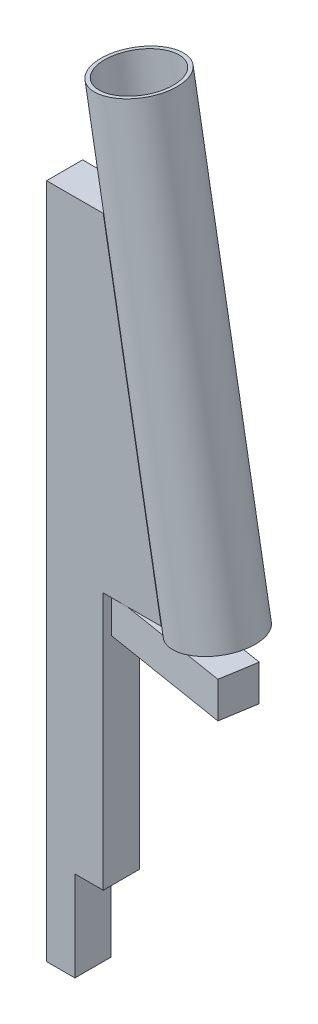
ISO-10303-21;
HEADER;
FILE_DESCRIPTION(('STEP AP214'),'2;1');
FILE_NAME('part.step','',(''),(''),'','','');
FILE_SCHEMA(('AUTOMOTIVE_DESIGN { 1 0 10303 214 1 1 1 1 }'));
ENDSEC;
DATA;
#1=APPLICATION_CONTEXT('core data for automotive mechanical design processes');
#2=APPLICATION_PROTOCOL_DEFINITION('international standard','automotive_design',2000,#1);
#3=PRODUCT_CONTEXT('',#1,'mechanical');
#4=PRODUCT('Part','Part','',(#3));
#5=PRODUCT_RELATED_PRODUCT_CATEGORY('part','',(#4));
#6=PRODUCT_DEFINITION_FORMATION('','',#4);
#7=PRODUCT_DEFINITION_CONTEXT('part definition',#1,'design');
#8=PRODUCT_DEFINITION('design','',#6,#7);
#9=PRODUCT_DEFINITION_SHAPE('','',#8);
#10=(LENGTH_UNIT() NAMED_UNIT(*) SI_UNIT(.MILLI.,.METRE.));
#11=(NAMED_UNIT(*) PLANE_ANGLE_UNIT() SI_UNIT($,.RADIAN.));
#12=(NAMED_UNIT(*) SI_UNIT($,.STERADIAN.) SOLID_ANGLE_UNIT());
#13=UNCERTAINTY_MEASURE_WITH_UNIT(LENGTH_MEASURE(1.E-05),#10,'distance_accuracy_value','');
#14=(GEOMETRIC_REPRESENTATION_CONTEXT(3) GLOBAL_UNCERTAINTY_ASSIGNED_CONTEXT((#13)) GLOBAL_UNIT_ASSIGNED_CONTEXT((#10,
#11,#12)) REPRESENTATION_CONTEXT('',''));
#15=CARTESIAN_POINT('',(0.,0.,0.));
#16=DIRECTION('',(0.,0.,1.));
#17=DIRECTION('',(1.,0.,0.));
#18=AXIS2_PLACEMENT_3D('',#15,#16,#17);
#19=CARTESIAN_POINT('',(57.7673704069417,619.892158884281,0.));
#20=DIRECTION('',(0.173648177666927,-0.984807753012209,0.));
#21=DIRECTION('',(0.984807753012209,0.173648177666927,0.));
#22=AXIS2_PLACEMENT_3D('',#19,#20,#21);
#23=CYLINDRICAL_SURFACE('',#22,30.);
#24=CARTESIAN_POINT('',(57.7673704069417,619.892158884281,0.));
#25=DIRECTION('',(0.173648177666927,-0.984807753012209,0.));
#26=DIRECTION('',(0.984807753012209,0.173648177666927,0.));
#27=AXIS2_PLACEMENT_3D('',#24,#25,#26);
#28=CIRCLE('',#27,30.);
#29=CARTESIAN_POINT('',(87.3116029973079,625.101604214288,0.));
#30=VERTEX_POINT('',#29);
#31=EDGE_CURVE('E11',#30,#30,#28,.T.);
#32=ORIENTED_EDGE('',*,*,#31,.T.);
#33=EDGE_LOOP('',(#32));
#34=FACE_BOUND('',#33,.T.);
#35=CARTESIAN_POINT('',(118.544232590366,275.209445330008,0.));
#36=DIRECTION('',(0.173648177666927,-0.984807753012209,0.));
#37=DIRECTION('',(0.984807753012209,0.173648177666927,0.));
#38=AXIS2_PLACEMENT_3D('',#35,#36,#37);
#39=CIRCLE('',#38,30.);
#40=CARTESIAN_POINT('',(148.088465180732,280.418890660016,0.));
#41=VERTEX_POINT('',#40);
#42=EDGE_CURVE('E43',#41,#41,#39,.T.);
#43=ORIENTED_EDGE('',*,*,#42,.F.);
#44=EDGE_LOOP('',(#43));
#45=FACE_BOUND('',#44,.T.);
#46=ADVANCED_FACE('F40',(#34,#45),#23,.T.);
#47=CARTESIAN_POINT('',(57.7673704069417,619.892158884281,0.));
#48=DIRECTION('',(0.173648177666927,-0.984807753012209,0.));
#49=DIRECTION('',(0.984807753012209,0.173648177666927,0.));
#50=AXIS2_PLACEMENT_3D('',#47,#48,#49);
#51=PLANE('',#50);
#52=CARTESIAN_POINT('',(57.7673704069417,619.892158884281,0.));
#53=DIRECTION('',(0.173648177666927,-0.984807753012209,0.));
#54=DIRECTION('',(0.984807753012209,0.173648177666927,0.));
#55=AXIS2_PLACEMENT_3D('',#52,#53,#54);
#56=CIRCLE('',#55,27.);
#57=CARTESIAN_POINT('',(84.3571797382713,624.580659681288,0.));
#58=VERTEX_POINT('',#57);
#59=EDGE_CURVE('E50',#58,#58,#56,.T.);
#60=ORIENTED_EDGE('',*,*,#59,.T.);
#61=EDGE_LOOP('',(#60));
#62=FACE_BOUND('',#61,.T.);
#63=ORIENTED_EDGE('',*,*,#31,.F.);
#64=EDGE_LOOP('',(#63));
#65=FACE_BOUND('',#64,.T.);
#66=ADVANCED_FACE('F58',(#62,#65),#51,.F.);
#67=CARTESIAN_POINT('',(118.544232590366,275.209445330008,0.));
#68=DIRECTION('',(0.173648177666927,-0.984807753012209,0.));
#69=DIRECTION('',(0.984807753012209,0.173648177666927,0.));
#70=AXIS2_PLACEMENT_3D('',#67,#68,#69);
#71=PLANE('',#70);
#72=CARTESIAN_POINT('',(118.544232590366,275.209445330008,0.));
#73=DIRECTION('',(0.173648177666927,-0.984807753012209,0.));
#74=DIRECTION('',(0.984807753012209,0.173648177666927,0.));
#75=AXIS2_PLACEMENT_3D('',#72,#73,#74);
#76=CIRCLE('',#75,27.);
#77=CARTESIAN_POINT('',(145.134041921696,279.897946127015,0.));
#78=VERTEX_POINT('',#77);
#79=EDGE_CURVE('E52',#78,#78,#76,.T.);
#80=ORIENTED_EDGE('',*,*,#79,.F.);
#81=EDGE_LOOP('',(#80));
#82=FACE_BOUND('',#81,.T.);
#83=ORIENTED_EDGE('',*,*,#42,.T.);
#84=EDGE_LOOP('',(#83));
#85=FACE_BOUND('',#84,.T.);
#86=ADVANCED_FACE('F64',(#82,#85),#71,.T.);
#87=CARTESIAN_POINT('',(57.7673704069417,619.892158884281,0.));
#88=DIRECTION('',(0.173648177666927,-0.984807753012209,0.));
#89=DIRECTION('',(0.984807753012209,0.173648177666927,0.));
#90=AXIS2_PLACEMENT_3D('',#87,#88,#89);
#91=CYLINDRICAL_SURFACE('',#90,27.);
#92=ORIENTED_EDGE('',*,*,#59,.F.);
#93=EDGE_LOOP('',(#92));
#94=FACE_BOUND('',#93,.T.);
#95=ORIENTED_EDGE('',*,*,#79,.T.);
#96=EDGE_LOOP('',(#95));
#97=FACE_BOUND('',#96,.T.);
#98=ADVANCED_FACE('F61',(#94,#97),#91,.F.);
#99=CLOSED_SHELL('',(#46,#66,#86,#98));
#100=MANIFOLD_SOLID_BREP('B2',#99);
#101=CARTESIAN_POINT('',(44.,270.,14.));
#102=DIRECTION('',(0.,1.,0.));
#103=DIRECTION('',(0.,0.,1.));
#104=AXIS2_PLACEMENT_3D('',#101,#102,#103);
#105=PLANE('',#104);
#106=DIRECTION('',(0.987007269930511,0.,0.160675602081711));
#107=VECTOR('',#106,1.);
#108=CARTESIAN_POINT('',(52.4313566501168,270.,-16.0675602081711));
#109=LINE('',#108,#107);
#110=CARTESIAN_POINT('',(65.1320836431679,270.,-14.));
#111=VERTEX_POINT('',#110);
#112=CARTESIAN_POINT('',(89.,270.,-10.1145252442366));
#113=VERTEX_POINT('',#112);
#114=EDGE_CURVE('E328',#111,#113,#109,.T.);
#115=ORIENTED_EDGE('',*,*,#114,.F.);
#116=DIRECTION('',(1.,0.,0.));
#117=VECTOR('',#116,1.);
#118=CARTESIAN_POINT('',(44.,270.,-14.));
#119=LINE('',#118,#117);
#120=CARTESIAN_POINT('',(89.,270.,-14.));
#121=VERTEX_POINT('',#120);
#122=EDGE_CURVE('E270',#111,#121,#119,.T.);
#123=ORIENTED_EDGE('',*,*,#122,.T.);
#124=DIRECTION('',(0.,0.,-1.));
#125=VECTOR('',#124,1.);
#126=CARTESIAN_POINT('',(89.,270.,14.));
#127=LINE('',#126,#125);
#128=EDGE_CURVE('E124',#113,#121,#127,.T.);
#129=ORIENTED_EDGE('',*,*,#128,.F.);
#130=EDGE_LOOP('',(#115,#123,#129));
#131=FACE_BOUND('',#130,.T.);
#132=ADVANCED_FACE('F101',(#131),#105,.F.);
#133=DIRECTION('',(0.160675602081711,0.,-0.98700726993051));
#134=VECTOR('',#133,1.);
#135=CARTESIAN_POINT('',(47.9324397918289,270.,11.5686433498832));
#136=LINE('',#135,#134);
#137=CARTESIAN_POINT('',(47.9324397918289,270.,11.5686433498832));
#138=VERTEX_POINT('',#137);
#139=CARTESIAN_POINT('',(52.0947770813448,270.,-14.));
#140=VERTEX_POINT('',#139);
#141=EDGE_CURVE('E116',#138,#140,#136,.T.);
#142=ORIENTED_EDGE('',*,*,#141,.F.);
#143=DIRECTION('',(-0.98700726993051,0.,-0.160675602081711));
#144=VECTOR('',#143,1.);
#145=CARTESIAN_POINT('',(47.9324397918289,270.,11.5686433498832));
#146=LINE('',#145,#144);
#147=CARTESIAN_POINT('',(62.8679163568321,270.,14.));
#148=VERTEX_POINT('',#147);
#149=EDGE_CURVE('E337',#148,#138,#146,.T.);
#150=ORIENTED_EDGE('',*,*,#149,.F.);
#151=DIRECTION('',(1.,0.,0.));
#152=VECTOR('',#151,1.);
#153=CARTESIAN_POINT('',(44.,270.,14.));
#154=LINE('',#153,#152);
#155=CARTESIAN_POINT('',(44.,270.,14.));
#156=VERTEX_POINT('',#155);
#157=EDGE_CURVE('E252',#156,#148,#154,.T.);
#158=ORIENTED_EDGE('',*,*,#157,.F.);
#159=DIRECTION('',(0.,0.,-1.));
#160=VECTOR('',#159,1.);
#161=CARTESIAN_POINT('',(44.,270.,14.));
#162=LINE('',#161,#160);
#163=CARTESIAN_POINT('',(44.,270.,-14.));
#164=VERTEX_POINT('',#163);
#165=EDGE_CURVE('E279',#156,#164,#162,.T.);
#166=ORIENTED_EDGE('',*,*,#165,.T.);
#167=EDGE_CURVE('E271',#164,#140,#119,.T.);
#168=ORIENTED_EDGE('',*,*,#167,.T.);
#169=EDGE_LOOP('',(#142,#150,#158,#166,#168));
#170=FACE_BOUND('',#169,.T.);
#171=ADVANCED_FACE('F358',(#170),#105,.F.);
#172=CARTESIAN_POINT('',(44.,525.207681882802,14.));
#173=DIRECTION('',(0.,-1.,0.));
#174=DIRECTION('',(0.,0.,-1.));
#175=AXIS2_PLACEMENT_3D('',#172,#173,#174);
#176=PLANE('',#175);
#177=DIRECTION('',(-1.,0.,0.));
#178=VECTOR('',#177,1.);
#179=CARTESIAN_POINT('',(44.,525.207681882802,-14.));
#180=LINE('',#179,#178);
#181=CARTESIAN_POINT('',(44.,525.207681882802,-14.));
#182=VERTEX_POINT('',#181);
#183=CARTESIAN_POINT('',(0.,525.207681882802,-14.));
#184=VERTEX_POINT('',#183);
#185=EDGE_CURVE('E232',#182,#184,#180,.T.);
#186=ORIENTED_EDGE('',*,*,#185,.T.);
#187=DIRECTION('',(0.,0.,-1.));
#188=VECTOR('',#187,1.);
#189=CARTESIAN_POINT('',(0.,525.207681882802,14.));
#190=LINE('',#189,#188);
#191=CARTESIAN_POINT('',(0.,525.207681882802,14.));
#192=VERTEX_POINT('',#191);
#193=EDGE_CURVE('E38',#192,#184,#190,.T.);
#194=ORIENTED_EDGE('',*,*,#193,.F.);
#195=DIRECTION('',(-1.,0.,0.));
#196=VECTOR('',#195,1.);
#197=CARTESIAN_POINT('',(44.,525.207681882802,14.));
#198=LINE('',#197,#196);
#199=CARTESIAN_POINT('',(44.,525.207681882802,14.));
#200=VERTEX_POINT('',#199);
#201=EDGE_CURVE('E238',#200,#192,#198,.T.);
#202=ORIENTED_EDGE('',*,*,#201,.F.);
#203=DIRECTION('',(0.,0.,-1.));
#204=VECTOR('',#203,1.);
#205=CARTESIAN_POINT('',(44.,525.207681882802,14.));
#206=LINE('',#205,#204);
#207=EDGE_CURVE('E257',#200,#182,#206,.T.);
#208=ORIENTED_EDGE('',*,*,#207,.T.);
#209=EDGE_LOOP('',(#186,#194,#202,#208));
#210=FACE_BOUND('',#209,.T.);
#211=ADVANCED_FACE('F103',(#210),#176,.F.);
#212=CARTESIAN_POINT('',(0.,525.207681882802,14.));
#213=DIRECTION('',(1.,0.,0.));
#214=DIRECTION('',(0.,1.,0.));
#215=AXIS2_PLACEMENT_3D('',#212,#213,#214);
#216=PLANE('',#215);
#217=DIRECTION('',(0.,-1.,0.));
#218=VECTOR('',#217,1.);
#219=CARTESIAN_POINT('',(0.,525.207681882802,-14.));
#220=LINE('',#219,#218);
#221=CARTESIAN_POINT('',(0.,0.,-14.));
#222=VERTEX_POINT('',#221);
#223=EDGE_CURVE('E260',#184,#222,#220,.T.);
#224=ORIENTED_EDGE('',*,*,#223,.T.);
#225=DIRECTION('',(0.,0.,-1.));
#226=VECTOR('',#225,1.);
#227=CARTESIAN_POINT('',(0.,0.,14.));
#228=LINE('',#227,#226);
#229=CARTESIAN_POINT('',(0.,0.,14.));
#230=VERTEX_POINT('',#229);
#231=EDGE_CURVE('E109',#230,#222,#228,.T.);
#232=ORIENTED_EDGE('',*,*,#231,.F.);
#233=DIRECTION('',(0.,-1.,0.));
#234=VECTOR('',#233,1.);
#235=CARTESIAN_POINT('',(0.,525.207681882802,14.));
#236=LINE('',#235,#234);
#237=EDGE_CURVE('E241',#192,#230,#236,.T.);
#238=ORIENTED_EDGE('',*,*,#237,.F.);
#239=ORIENTED_EDGE('',*,*,#193,.T.);
#240=EDGE_LOOP('',(#224,#232,#238,#239));
#241=FACE_BOUND('',#240,.T.);
#242=ADVANCED_FACE('F318',(#241),#216,.F.);
#243=CARTESIAN_POINT('',(0.,0.,14.));
#244=DIRECTION('',(0.,1.,0.));
#245=DIRECTION('',(0.,0.,1.));
#246=AXIS2_PLACEMENT_3D('',#243,#244,#245);
#247=PLANE('',#246);
#248=DIRECTION('',(1.,0.,0.));
#249=VECTOR('',#248,1.);
#250=CARTESIAN_POINT('',(0.,0.,-14.));
#251=LINE('',#250,#249);
#252=CARTESIAN_POINT('',(22.,0.,-14.));
#253=VERTEX_POINT('',#252);
#254=EDGE_CURVE('E262',#222,#253,#251,.T.);
#255=ORIENTED_EDGE('',*,*,#254,.T.);
#256=DIRECTION('',(0.,0.,-1.));
#257=VECTOR('',#256,1.);
#258=CARTESIAN_POINT('',(22.,0.,14.));
#259=LINE('',#258,#257);
#260=CARTESIAN_POINT('',(22.,0.,14.));
#261=VERTEX_POINT('',#260);
#262=EDGE_CURVE('E288',#261,#253,#259,.T.);
#263=ORIENTED_EDGE('',*,*,#262,.F.);
#264=DIRECTION('',(1.,0.,0.));
#265=VECTOR('',#264,1.);
#266=CARTESIAN_POINT('',(0.,0.,14.));
#267=LINE('',#266,#265);
#268=EDGE_CURVE('E244',#230,#261,#267,.T.);
#269=ORIENTED_EDGE('',*,*,#268,.F.);
#270=ORIENTED_EDGE('',*,*,#231,.T.);
#271=EDGE_LOOP('',(#255,#263,#269,#270));
#272=FACE_BOUND('',#271,.T.);
#273=ADVANCED_FACE('F295',(#272),#247,.F.);
#274=CARTESIAN_POINT('',(22.,0.,14.));
#275=DIRECTION('',(-1.,0.,0.));
#276=DIRECTION('',(0.,0.,1.));
#277=AXIS2_PLACEMENT_3D('',#274,#275,#276);
#278=PLANE('',#277);
#279=DIRECTION('',(0.,1.,0.));
#280=VECTOR('',#279,1.);
#281=CARTESIAN_POINT('',(22.,0.,-14.));
#282=LINE('',#281,#280);
#283=CARTESIAN_POINT('',(22.,70.,-14.));
#284=VERTEX_POINT('',#283);
#285=EDGE_CURVE('E264',#253,#284,#282,.T.);
#286=ORIENTED_EDGE('',*,*,#285,.T.);
#287=DIRECTION('',(0.,0.,-1.));
#288=VECTOR('',#287,1.);
#289=CARTESIAN_POINT('',(22.,70.,14.));
#290=LINE('',#289,#288);
#291=CARTESIAN_POINT('',(22.,70.,14.));
#292=VERTEX_POINT('',#291);
#293=EDGE_CURVE('E285',#292,#284,#290,.T.);
#294=ORIENTED_EDGE('',*,*,#293,.F.);
#295=DIRECTION('',(0.,1.,0.));
#296=VECTOR('',#295,1.);
#297=CARTESIAN_POINT('',(22.,0.,14.));
#298=LINE('',#297,#296);
#299=EDGE_CURVE('E246',#261,#292,#298,.T.);
#300=ORIENTED_EDGE('',*,*,#299,.F.);
#301=ORIENTED_EDGE('',*,*,#262,.T.);
#302=EDGE_LOOP('',(#286,#294,#300,#301));
#303=FACE_BOUND('',#302,.T.);
#304=ADVANCED_FACE('F306',(#303),#278,.F.);
#305=CARTESIAN_POINT('',(22.,70.,14.));
#306=DIRECTION('',(0.,1.,0.));
#307=DIRECTION('',(0.,0.,1.));
#308=AXIS2_PLACEMENT_3D('',#305,#306,#307);
#309=PLANE('',#308);
#310=DIRECTION('',(1.,0.,0.));
#311=VECTOR('',#310,1.);
#312=CARTESIAN_POINT('',(22.,70.,-14.));
#313=LINE('',#312,#311);
#314=CARTESIAN_POINT('',(44.,70.,-14.));
#315=VERTEX_POINT('',#314);
#316=EDGE_CURVE('E266',#284,#315,#313,.T.);
#317=ORIENTED_EDGE('',*,*,#316,.T.);
#318=DIRECTION('',(0.,0.,-1.));
#319=VECTOR('',#318,1.);
#320=CARTESIAN_POINT('',(44.,70.,14.));
#321=LINE('',#320,#319);
#322=CARTESIAN_POINT('',(44.,70.,14.));
#323=VERTEX_POINT('',#322);
#324=EDGE_CURVE('E282',#323,#315,#321,.T.);
#325=ORIENTED_EDGE('',*,*,#324,.F.);
#326=DIRECTION('',(1.,0.,0.));
#327=VECTOR('',#326,1.);
#328=CARTESIAN_POINT('',(22.,70.,14.));
#329=LINE('',#328,#327);
#330=EDGE_CURVE('E248',#292,#323,#329,.T.);
#331=ORIENTED_EDGE('',*,*,#330,.F.);
#332=ORIENTED_EDGE('',*,*,#293,.T.);
#333=EDGE_LOOP('',(#317,#325,#331,#332));
#334=FACE_BOUND('',#333,.T.);
#335=ADVANCED_FACE('F310',(#334),#309,.F.);
#336=CARTESIAN_POINT('',(44.,70.,14.));
#337=DIRECTION('',(-1.,0.,0.));
#338=DIRECTION('',(0.,0.,1.));
#339=AXIS2_PLACEMENT_3D('',#336,#337,#338);
#340=PLANE('',#339);
#341=DIRECTION('',(0.,1.,0.));
#342=VECTOR('',#341,1.);
#343=CARTESIAN_POINT('',(44.,70.,-14.));
#344=LINE('',#343,#342);
#345=EDGE_CURVE('E268',#315,#164,#344,.T.);
#346=ORIENTED_EDGE('',*,*,#345,.T.);
#347=ORIENTED_EDGE('',*,*,#165,.F.);
#348=DIRECTION('',(0.,1.,0.));
#349=VECTOR('',#348,1.);
#350=CARTESIAN_POINT('',(44.,70.,14.));
#351=LINE('',#350,#349);
#352=EDGE_CURVE('E250',#323,#156,#351,.T.);
#353=ORIENTED_EDGE('',*,*,#352,.F.);
#354=ORIENTED_EDGE('',*,*,#324,.T.);
#355=EDGE_LOOP('',(#346,#347,#353,#354));
#356=FACE_BOUND('',#355,.T.);
#357=ADVANCED_FACE('F360',(#356),#340,.F.);
#358=CARTESIAN_POINT('',(89.,270.,14.));
#359=DIRECTION('',(-0.984807753012209,-0.173648177666927,0.));
#360=DIRECTION('',(0.173648177666927,-0.984807753012209,0.));
#361=AXIS2_PLACEMENT_3D('',#358,#359,#360);
#362=PLANE('',#361);
#363=DIRECTION('',(-0.173648177666927,0.984807753012208,0.));
#364=VECTOR('',#363,1.);
#365=CARTESIAN_POINT('',(89.,270.,-14.));
#366=LINE('',#365,#364);
#367=EDGE_CURVE('E242',#121,#182,#366,.T.);
#368=ORIENTED_EDGE('',*,*,#367,.T.);
#369=ORIENTED_EDGE('',*,*,#207,.F.);
#370=DIRECTION('',(-0.173648177666927,0.984807753012208,0.));
#371=VECTOR('',#370,1.);
#372=CARTESIAN_POINT('',(89.,270.,14.));
#373=LINE('',#372,#371);
#374=CARTESIAN_POINT('',(89.,270.,14.));
#375=VERTEX_POINT('',#374);
#376=EDGE_CURVE('E255',#375,#200,#373,.T.);
#377=ORIENTED_EDGE('',*,*,#376,.F.);
#378=EDGE_CURVE('E277',#375,#113,#127,.T.);
#379=ORIENTED_EDGE('',*,*,#378,.T.);
#380=ORIENTED_EDGE('',*,*,#128,.T.);
#381=EDGE_LOOP('',(#368,#369,#377,#379,#380));
#382=FACE_BOUND('',#381,.T.);
#383=ADVANCED_FACE('F323',(#382),#362,.F.);
#384=CARTESIAN_POINT('',(0.,0.,14.));
#385=DIRECTION('',(0.,0.,1.));
#386=DIRECTION('',(1.,0.,0.));
#387=AXIS2_PLACEMENT_3D('',#384,#385,#386);
#388=PLANE('',#387);
#389=ORIENTED_EDGE('',*,*,#201,.T.);
#390=ORIENTED_EDGE('',*,*,#237,.T.);
#391=ORIENTED_EDGE('',*,*,#268,.T.);
#392=ORIENTED_EDGE('',*,*,#299,.T.);
#393=ORIENTED_EDGE('',*,*,#330,.T.);
#394=ORIENTED_EDGE('',*,*,#352,.T.);
#395=ORIENTED_EDGE('',*,*,#157,.T.);
#396=DIRECTION('',(1.,0.,0.));
#397=VECTOR('',#396,1.);
#398=CARTESIAN_POINT('',(0.,270.,14.));
#399=LINE('',#398,#397);
#400=EDGE_CURVE('E230',#148,#375,#399,.T.);
#401=ORIENTED_EDGE('',*,*,#400,.T.);
#402=ORIENTED_EDGE('',*,*,#376,.T.);
#403=EDGE_LOOP('',(#389,#390,#391,#392,#393,#394,#395,#401,#402));
#404=FACE_BOUND('',#403,.T.);
#405=ADVANCED_FACE('F314',(#404),#388,.T.);
#406=CARTESIAN_POINT('',(0.,0.,-14.));
#407=DIRECTION('',(0.,0.,1.));
#408=DIRECTION('',(1.,0.,0.));
#409=AXIS2_PLACEMENT_3D('',#406,#407,#408);
#410=PLANE('',#409);
#411=ORIENTED_EDGE('',*,*,#185,.F.);
#412=ORIENTED_EDGE('',*,*,#367,.F.);
#413=ORIENTED_EDGE('',*,*,#122,.F.);
#414=EDGE_CURVE('E273',#140,#111,#119,.T.);
#415=ORIENTED_EDGE('',*,*,#414,.F.);
#416=ORIENTED_EDGE('',*,*,#167,.F.);
#417=ORIENTED_EDGE('',*,*,#345,.F.);
#418=ORIENTED_EDGE('',*,*,#316,.F.);
#419=ORIENTED_EDGE('',*,*,#285,.F.);
#420=ORIENTED_EDGE('',*,*,#254,.F.);
#421=ORIENTED_EDGE('',*,*,#223,.F.);
#422=EDGE_LOOP('',(#411,#412,#413,#415,#416,#417,#418,#419,#420,#421));
#423=FACE_BOUND('',#422,.T.);
#424=ADVANCED_FACE('F301',(#423),#410,.F.);
#425=CARTESIAN_POINT('',(0.,270.,0.));
#426=DIRECTION('',(0.,-1.,0.));
#427=DIRECTION('',(0.,0.,-1.));
#428=AXIS2_PLACEMENT_3D('',#425,#426,#427);
#429=PLANE('',#428);
#430=CARTESIAN_POINT('',(151.132083643168,270.,0.));
#431=VERTEX_POINT('',#430);
#432=EDGE_CURVE('E336',#113,#431,#109,.T.);
#433=ORIENTED_EDGE('',*,*,#432,.F.);
#434=ORIENTED_EDGE('',*,*,#378,.F.);
#435=ORIENTED_EDGE('',*,*,#400,.F.);
#436=CARTESIAN_POINT('',(146.63316678488,270.,27.6362035580543));
#437=VERTEX_POINT('',#436);
#438=EDGE_CURVE('E224',#437,#148,#146,.T.);
#439=ORIENTED_EDGE('',*,*,#438,.F.);
#440=DIRECTION('',(-0.16067560208171,0.,0.987007269930511));
#441=VECTOR('',#440,1.);
#442=CARTESIAN_POINT('',(146.63316678488,270.,27.6362035580543));
#443=LINE('',#442,#441);
#444=EDGE_CURVE('E334',#431,#437,#443,.T.);
#445=ORIENTED_EDGE('',*,*,#444,.F.);
#446=EDGE_LOOP('',(#433,#434,#435,#439,#445));
#447=FACE_BOUND('',#446,.T.);
#448=ADVANCED_FACE('F356',(#447),#429,.F.);
#449=CARTESIAN_POINT('',(52.4313566501168,270.,-16.0675602081711));
#450=VERTEX_POINT('',#449);
#451=EDGE_CURVE('E228',#140,#450,#136,.T.);
#452=ORIENTED_EDGE('',*,*,#451,.F.);
#453=ORIENTED_EDGE('',*,*,#414,.T.);
#454=EDGE_CURVE('E332',#450,#111,#109,.T.);
#455=ORIENTED_EDGE('',*,*,#454,.F.);
#456=EDGE_LOOP('',(#452,#453,#455));
#457=FACE_BOUND('',#456,.T.);
#458=ADVANCED_FACE('F331',(#457),#429,.F.);
#459=CARTESIAN_POINT('',(47.9324397918289,242.,11.5686433498832));
#460=DIRECTION('',(0.98700726993051,0.,0.160675602081711));
#461=DIRECTION('',(0.160675602081711,0.,-0.98700726993051));
#462=AXIS2_PLACEMENT_3D('',#459,#460,#461);
#463=PLANE('',#462);
#464=ORIENTED_EDGE('',*,*,#141,.T.);
#465=ORIENTED_EDGE('',*,*,#451,.T.);
#466=DIRECTION('',(0.,1.,0.));
#467=VECTOR('',#466,1.);
#468=CARTESIAN_POINT('',(52.4313566501168,242.,-16.0675602081711));
#469=LINE('',#468,#467);
#470=CARTESIAN_POINT('',(52.4313566501168,242.,-16.0675602081711));
#471=VERTEX_POINT('',#470);
#472=EDGE_CURVE('E209',#471,#450,#469,.T.);
#473=ORIENTED_EDGE('',*,*,#472,.F.);
#474=DIRECTION('',(0.160675602081711,0.,-0.98700726993051));
#475=VECTOR('',#474,1.);
#476=CARTESIAN_POINT('',(47.9324397918289,242.,11.5686433498832));
#477=LINE('',#476,#475);
#478=CARTESIAN_POINT('',(47.9324397918289,242.,11.5686433498832));
#479=VERTEX_POINT('',#478);
#480=EDGE_CURVE('E215',#479,#471,#477,.T.);
#481=ORIENTED_EDGE('',*,*,#480,.F.);
#482=DIRECTION('',(0.,1.,0.));
#483=VECTOR('',#482,1.);
#484=CARTESIAN_POINT('',(47.9324397918289,242.,11.5686433498832));
#485=LINE('',#484,#483);
#486=EDGE_CURVE('E342',#479,#138,#485,.T.);
#487=ORIENTED_EDGE('',*,*,#486,.T.);
#488=EDGE_LOOP('',(#464,#465,#473,#481,#487));
#489=FACE_BOUND('',#488,.T.);
#490=ADVANCED_FACE('F226',(#489),#463,.F.);
#491=CARTESIAN_POINT('',(52.4313566501168,242.,-16.0675602081711));
#492=DIRECTION('',(-0.160675602081711,0.,0.987007269930511));
#493=DIRECTION('',(0.987007269930511,0.,0.160675602081711));
#494=AXIS2_PLACEMENT_3D('',#491,#492,#493);
#495=PLANE('',#494);
#496=ORIENTED_EDGE('',*,*,#454,.T.);
#497=ORIENTED_EDGE('',*,*,#114,.T.);
#498=ORIENTED_EDGE('',*,*,#432,.T.);
#499=DIRECTION('',(0.,1.,0.));
#500=VECTOR('',#499,1.);
#501=CARTESIAN_POINT('',(151.132083643168,242.,0.));
#502=LINE('',#501,#500);
#503=CARTESIAN_POINT('',(151.132083643168,242.,0.));
#504=VERTEX_POINT('',#503);
#505=EDGE_CURVE('E211',#504,#431,#502,.T.);
#506=ORIENTED_EDGE('',*,*,#505,.F.);
#507=DIRECTION('',(0.987007269930511,0.,0.160675602081711));
#508=VECTOR('',#507,1.);
#509=CARTESIAN_POINT('',(52.4313566501168,242.,-16.0675602081711));
#510=LINE('',#509,#508);
#511=EDGE_CURVE('E204',#471,#504,#510,.T.);
#512=ORIENTED_EDGE('',*,*,#511,.F.);
#513=ORIENTED_EDGE('',*,*,#472,.T.);
#514=EDGE_LOOP('',(#496,#497,#498,#506,#512,#513));
#515=FACE_BOUND('',#514,.T.);
#516=ADVANCED_FACE('F207',(#515),#495,.F.);
#517=CARTESIAN_POINT('',(146.63316678488,242.,27.6362035580543));
#518=DIRECTION('',(-0.987007269930511,0.,-0.16067560208171));
#519=DIRECTION('',(-0.16067560208171,0.,0.987007269930511));
#520=AXIS2_PLACEMENT_3D('',#517,#518,#519);
#521=PLANE('',#520);
#522=ORIENTED_EDGE('',*,*,#444,.T.);
#523=DIRECTION('',(0.,1.,0.));
#524=VECTOR('',#523,1.);
#525=CARTESIAN_POINT('',(146.63316678488,242.,27.6362035580543));
#526=LINE('',#525,#524);
#527=CARTESIAN_POINT('',(146.63316678488,242.,27.6362035580543));
#528=VERTEX_POINT('',#527);
#529=EDGE_CURVE('E234',#528,#437,#526,.T.);
#530=ORIENTED_EDGE('',*,*,#529,.F.);
#531=DIRECTION('',(-0.16067560208171,0.,0.987007269930511));
#532=VECTOR('',#531,1.);
#533=CARTESIAN_POINT('',(146.63316678488,242.,27.6362035580543));
#534=LINE('',#533,#532);
#535=EDGE_CURVE('E214',#504,#528,#534,.T.);
#536=ORIENTED_EDGE('',*,*,#535,.F.);
#537=ORIENTED_EDGE('',*,*,#505,.T.);
#538=EDGE_LOOP('',(#522,#530,#536,#537));
#539=FACE_BOUND('',#538,.T.);
#540=ADVANCED_FACE('F346',(#539),#521,.F.);
#541=CARTESIAN_POINT('',(47.9324397918289,242.,11.5686433498832));
#542=DIRECTION('',(0.160675602081711,0.,-0.987007269930511));
#543=DIRECTION('',(-0.987007269930511,0.,-0.160675602081711));
#544=AXIS2_PLACEMENT_3D('',#541,#542,#543);
#545=PLANE('',#544);
#546=ORIENTED_EDGE('',*,*,#438,.T.);
#547=ORIENTED_EDGE('',*,*,#149,.T.);
#548=ORIENTED_EDGE('',*,*,#486,.F.);
#549=DIRECTION('',(-0.98700726993051,0.,-0.160675602081711));
#550=VECTOR('',#549,1.);
#551=CARTESIAN_POINT('',(47.9324397918289,242.,11.5686433498832));
#552=LINE('',#551,#550);
#553=EDGE_CURVE('E220',#528,#479,#552,.T.);
#554=ORIENTED_EDGE('',*,*,#553,.F.);
#555=ORIENTED_EDGE('',*,*,#529,.T.);
#556=EDGE_LOOP('',(#546,#547,#548,#554,#555));
#557=FACE_BOUND('',#556,.T.);
#558=ADVANCED_FACE('F351',(#557),#545,.F.);
#559=CARTESIAN_POINT('',(0.,242.,0.));
#560=DIRECTION('',(0.,-1.,0.));
#561=DIRECTION('',(0.,0.,-1.));
#562=AXIS2_PLACEMENT_3D('',#559,#560,#561);
#563=PLANE('',#562);
#564=ORIENTED_EDGE('',*,*,#480,.T.);
#565=ORIENTED_EDGE('',*,*,#511,.T.);
#566=ORIENTED_EDGE('',*,*,#535,.T.);
#567=ORIENTED_EDGE('',*,*,#553,.T.);
#568=EDGE_LOOP('',(#564,#565,#566,#567));
#569=FACE_BOUND('',#568,.T.);
#570=ADVANCED_FACE('F218',(#569),#563,.T.);
#571=CLOSED_SHELL('',(#132,#171,#211,#242,#273,#304,#335,#357,#383,#405,#424,#448,#458,#490,
#516,#540,#558,#570));
#572=MANIFOLD_SOLID_BREP('B6',#571);
#573=ADVANCED_BREP_SHAPE_REPRESENTATION('',(#18,#100,#572),#14);
#574=SHAPE_DEFINITION_REPRESENTATION(#9,#573);
ENDSEC;
END-ISO-10303-21;
